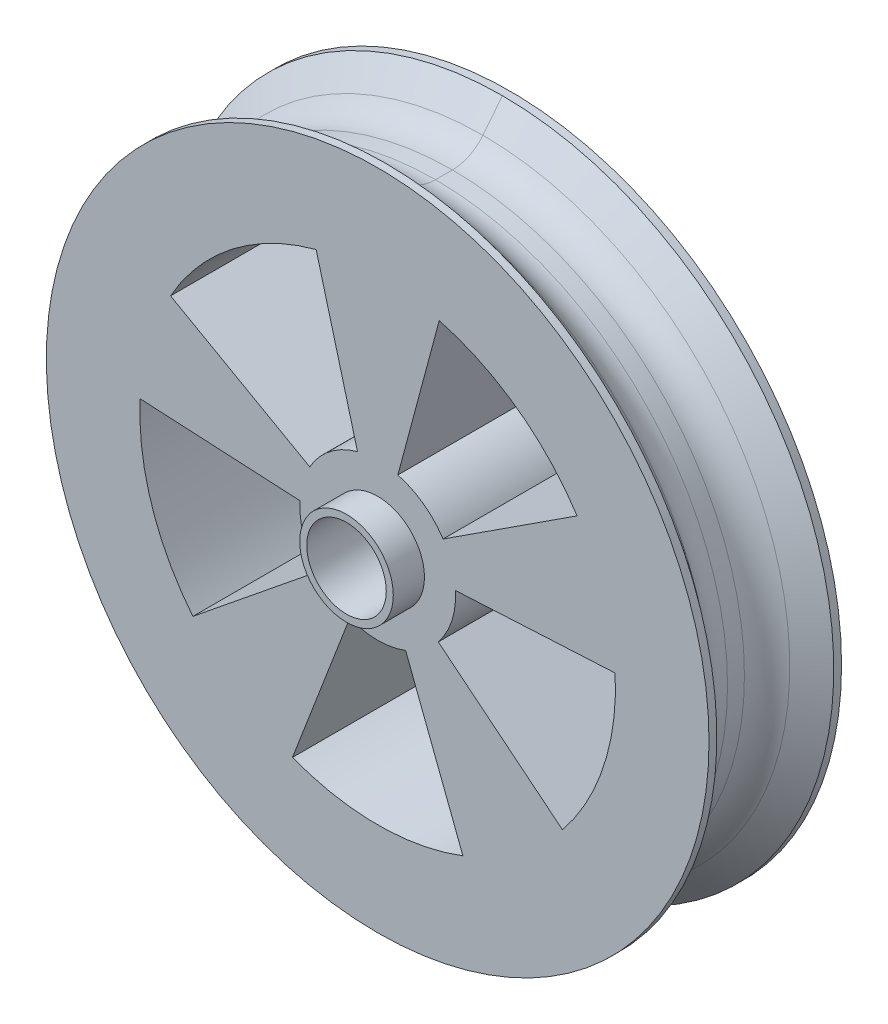
ISO-10303-21;
HEADER;
FILE_DESCRIPTION(('STEP AP214'),'2;1');
FILE_NAME('part.step','',(''),(''),'','','');
FILE_SCHEMA(('AUTOMOTIVE_DESIGN { 1 0 10303 214 1 1 1 1 }'));
ENDSEC;
DATA;
#1=APPLICATION_CONTEXT('core data for automotive mechanical design processes');
#2=APPLICATION_PROTOCOL_DEFINITION('international standard','automotive_design',2000,#1);
#3=PRODUCT_CONTEXT('',#1,'mechanical');
#4=PRODUCT('Part','Part','',(#3));
#5=PRODUCT_RELATED_PRODUCT_CATEGORY('part','',(#4));
#6=PRODUCT_DEFINITION_FORMATION('','',#4);
#7=PRODUCT_DEFINITION_CONTEXT('part definition',#1,'design');
#8=PRODUCT_DEFINITION('design','',#6,#7);
#9=PRODUCT_DEFINITION_SHAPE('','',#8);
#10=(LENGTH_UNIT() NAMED_UNIT(*) SI_UNIT(.MILLI.,.METRE.));
#11=(NAMED_UNIT(*) PLANE_ANGLE_UNIT() SI_UNIT($,.RADIAN.));
#12=(NAMED_UNIT(*) SI_UNIT($,.STERADIAN.) SOLID_ANGLE_UNIT());
#13=UNCERTAINTY_MEASURE_WITH_UNIT(LENGTH_MEASURE(1.E-05),#10,'distance_accuracy_value','');
#14=(GEOMETRIC_REPRESENTATION_CONTEXT(3) GLOBAL_UNCERTAINTY_ASSIGNED_CONTEXT((#13)) GLOBAL_UNIT_ASSIGNED_CONTEXT((#10,
#11,#12)) REPRESENTATION_CONTEXT('',''));
#15=CARTESIAN_POINT('',(0.,0.,0.));
#16=DIRECTION('',(0.,0.,1.));
#17=DIRECTION('',(1.,0.,0.));
#18=AXIS2_PLACEMENT_3D('',#15,#16,#17);
#19=CARTESIAN_POINT('',(0.,0.,7.41537261275771));
#20=DIRECTION('',(0.,0.,1.));
#21=DIRECTION('',(1.,0.,0.));
#22=AXIS2_PLACEMENT_3D('',#19,#20,#21);
#23=TOROIDAL_SURFACE('',#22,42.4590404977148,5.);
#24=CARTESIAN_POINT('',(0.,0.,7.41537261275771));
#25=DIRECTION('',(0.,0.,1.));
#26=DIRECTION('',(1.,0.,0.));
#27=AXIS2_PLACEMENT_3D('',#24,#25,#26);
#28=CIRCLE('',#27,37.4590404977148);
#29=CARTESIAN_POINT('',(0.,-37.4590404977148,7.41537261275771));
#30=VERTEX_POINT('',#29);
#31=CARTESIAN_POINT('',(0.,37.4590404977148,7.41537261275771));
#32=VERTEX_POINT('',#31);
#33=EDGE_CURVE('E452',#30,#32,#28,.T.);
#34=ORIENTED_EDGE('',*,*,#33,.F.);
#35=CARTESIAN_POINT('',(0.,-42.4590404977148,7.41537261275771));
#36=DIRECTION('',(-1.,0.,0.));
#37=DIRECTION('',(0.,0.,1.));
#38=AXIS2_PLACEMENT_3D('',#35,#36,#37);
#39=CIRCLE('',#38,5.);
#40=CARTESIAN_POINT('',(0.,-39.3511142328955,3.498640003497));
#41=VERTEX_POINT('',#40);
#42=EDGE_CURVE('E13',#30,#41,#39,.T.);
#43=ORIENTED_EDGE('',*,*,#42,.T.);
#44=CARTESIAN_POINT('',(0.,0.,3.498640003497));
#45=DIRECTION('',(0.,0.,1.));
#46=DIRECTION('',(1.,0.,0.));
#47=AXIS2_PLACEMENT_3D('',#44,#45,#46);
#48=CIRCLE('',#47,39.3511142328955);
#49=CARTESIAN_POINT('',(0.,39.3511142328955,3.498640003497));
#50=VERTEX_POINT('',#49);
#51=EDGE_CURVE('E456',#50,#41,#48,.F.);
#52=ORIENTED_EDGE('',*,*,#51,.F.);
#53=CARTESIAN_POINT('',(0.,42.4590404977148,7.41537261275771));
#54=DIRECTION('',(-1.,0.,0.));
#55=DIRECTION('',(0.,0.,1.));
#56=AXIS2_PLACEMENT_3D('',#53,#54,#55);
#57=CIRCLE('',#56,5.);
#58=EDGE_CURVE('E108',#50,#32,#57,.T.);
#59=ORIENTED_EDGE('',*,*,#58,.T.);
#60=EDGE_LOOP('',(#34,#43,#52,#59));
#61=FACE_BOUND('',#60,.T.);
#62=ADVANCED_FACE('F99',(#61),#23,.F.);
#63=CARTESIAN_POINT('',(0.,0.,0.));
#64=DIRECTION('',(0.,0.,1.));
#65=DIRECTION('',(1.,0.,0.));
#66=AXIS2_PLACEMENT_3D('',#63,#64,#65);
#67=CYLINDRICAL_SURFACE('',#66,37.4590404977148);
#68=EDGE_CURVE('E453',#32,#30,#28,.T.);
#69=ORIENTED_EDGE('',*,*,#68,.T.);
#70=DIRECTION('',(0.,0.,1.));
#71=VECTOR('',#70,1.);
#72=CARTESIAN_POINT('',(0.,-37.4590404977148,0.));
#73=LINE('',#72,#71);
#74=CARTESIAN_POINT('',(0.,-37.4590404977148,9.58462738724229));
#75=VERTEX_POINT('',#74);
#76=EDGE_CURVE('E493',#30,#75,#73,.T.);
#77=ORIENTED_EDGE('',*,*,#76,.T.);
#78=CARTESIAN_POINT('',(0.,0.,9.58462738724229));
#79=DIRECTION('',(0.,0.,1.));
#80=DIRECTION('',(1.,0.,0.));
#81=AXIS2_PLACEMENT_3D('',#78,#79,#80);
#82=CIRCLE('',#81,37.4590404977148);
#83=CARTESIAN_POINT('',(0.,37.4590404977148,9.58462738724229));
#84=VERTEX_POINT('',#83);
#85=EDGE_CURVE('E464',#75,#84,#82,.F.);
#86=ORIENTED_EDGE('',*,*,#85,.T.);
#87=DIRECTION('',(0.,0.,-1.));
#88=VECTOR('',#87,1.);
#89=CARTESIAN_POINT('',(0.,37.4590404977148,0.));
#90=LINE('',#89,#88);
#91=EDGE_CURVE('E489',#84,#32,#90,.T.);
#92=ORIENTED_EDGE('',*,*,#91,.T.);
#93=EDGE_LOOP('',(#69,#77,#86,#92));
#94=FACE_BOUND('',#93,.T.);
#95=ADVANCED_FACE('F518',(#94),#67,.T.);
#96=CARTESIAN_POINT('',(0.,0.,9.58462738724229));
#97=DIRECTION('',(0.,0.,1.));
#98=DIRECTION('',(1.,0.,0.));
#99=AXIS2_PLACEMENT_3D('',#96,#97,#98);
#100=TOROIDAL_SURFACE('',#99,42.4590404977148,5.);
#101=CARTESIAN_POINT('',(0.,0.,13.501359996503));
#102=DIRECTION('',(0.,0.,1.));
#103=DIRECTION('',(1.,0.,0.));
#104=AXIS2_PLACEMENT_3D('',#101,#102,#103);
#105=CIRCLE('',#104,39.3511142328955);
#106=CARTESIAN_POINT('',(0.,-39.3511142328954,13.501359996503));
#107=VERTEX_POINT('',#106);
#108=CARTESIAN_POINT('',(0.,39.3511142328954,13.501359996503));
#109=VERTEX_POINT('',#108);
#110=EDGE_CURVE('E460',#107,#109,#105,.T.);
#111=ORIENTED_EDGE('',*,*,#110,.F.);
#112=CARTESIAN_POINT('',(0.,-42.4590404977148,9.58462738724229));
#113=DIRECTION('',(-1.,0.,0.));
#114=DIRECTION('',(0.,0.,1.));
#115=AXIS2_PLACEMENT_3D('',#112,#113,#114);
#116=CIRCLE('',#115,5.);
#117=EDGE_CURVE('E485',#107,#75,#116,.T.);
#118=ORIENTED_EDGE('',*,*,#117,.T.);
#119=EDGE_CURVE('E465',#84,#75,#82,.F.);
#120=ORIENTED_EDGE('',*,*,#119,.F.);
#121=CARTESIAN_POINT('',(0.,42.4590404977148,9.58462738724229));
#122=DIRECTION('',(-1.,0.,0.));
#123=DIRECTION('',(0.,0.,1.));
#124=AXIS2_PLACEMENT_3D('',#121,#122,#123);
#125=CIRCLE('',#124,5.);
#126=EDGE_CURVE('E482',#84,#109,#125,.T.);
#127=ORIENTED_EDGE('',*,*,#126,.T.);
#128=EDGE_LOOP('',(#111,#118,#120,#127));
#129=FACE_BOUND('',#128,.T.);
#130=ADVANCED_FACE('F525',(#129),#100,.F.);
#131=CARTESIAN_POINT('',(0.,0.,12.));
#132=DIRECTION('',(0.,0.,1.));
#133=DIRECTION('',(1.,0.,0.));
#134=AXIS2_PLACEMENT_3D('',#131,#132,#133);
#135=CONICAL_SURFACE('',#134,37.4590404977148,0.900031551319247);
#136=EDGE_CURVE('E461',#109,#107,#105,.T.);
#137=ORIENTED_EDGE('',*,*,#136,.T.);
#138=DIRECTION('',(0.,-0.783346521852141,0.621585252963866));
#139=VECTOR('',#138,1.);
#140=CARTESIAN_POINT('',(0.,-37.4590404977148,12.));
#141=LINE('',#140,#139);
#142=CARTESIAN_POINT('',(0.,-42.5,16.));
#143=VERTEX_POINT('',#142);
#144=EDGE_CURVE('E479',#107,#143,#141,.T.);
#145=ORIENTED_EDGE('',*,*,#144,.T.);
#146=CARTESIAN_POINT('',(0.,0.,16.));
#147=DIRECTION('',(0.,0.,1.));
#148=DIRECTION('',(1.,0.,0.));
#149=AXIS2_PLACEMENT_3D('',#146,#147,#148);
#150=CIRCLE('',#149,42.5);
#151=CARTESIAN_POINT('',(0.,42.5,16.));
#152=VERTEX_POINT('',#151);
#153=EDGE_CURVE('E548',#152,#143,#150,.T.);
#154=ORIENTED_EDGE('',*,*,#153,.F.);
#155=DIRECTION('',(0.,-0.783346521852141,-0.621585252963866));
#156=VECTOR('',#155,1.);
#157=CARTESIAN_POINT('',(0.,37.4590404977148,12.));
#158=LINE('',#157,#156);
#159=EDGE_CURVE('E475',#152,#109,#158,.T.);
#160=ORIENTED_EDGE('',*,*,#159,.T.);
#161=EDGE_LOOP('',(#137,#145,#154,#160));
#162=FACE_BOUND('',#161,.T.);
#163=ADVANCED_FACE('F613',(#162),#135,.T.);
#164=CARTESIAN_POINT('',(0.,0.,5.));
#165=DIRECTION('',(0.,0.,-1.));
#166=DIRECTION('',(-1.,0.,0.));
#167=AXIS2_PLACEMENT_3D('',#164,#165,#166);
#168=CONICAL_SURFACE('',#167,37.4590404977148,0.900031551319247);
#169=EDGE_CURVE('E457',#41,#50,#48,.F.);
#170=ORIENTED_EDGE('',*,*,#169,.T.);
#171=DIRECTION('',(0.,0.783346521852141,-0.621585252963866));
#172=VECTOR('',#171,1.);
#173=CARTESIAN_POINT('',(0.,37.4590404977148,5.));
#174=LINE('',#173,#172);
#175=CARTESIAN_POINT('',(0.,42.5,0.999999999999997));
#176=VERTEX_POINT('',#175);
#177=EDGE_CURVE('E472',#50,#176,#174,.T.);
#178=ORIENTED_EDGE('',*,*,#177,.T.);
#179=CARTESIAN_POINT('',(0.,0.,0.999999999999997));
#180=DIRECTION('',(0.,0.,1.));
#181=DIRECTION('',(1.,0.,0.));
#182=AXIS2_PLACEMENT_3D('',#179,#180,#181);
#183=CIRCLE('',#182,42.5);
#184=CARTESIAN_POINT('',(0.,-42.5,0.999999999999997));
#185=VERTEX_POINT('',#184);
#186=EDGE_CURVE('E543',#176,#185,#183,.T.);
#187=ORIENTED_EDGE('',*,*,#186,.T.);
#188=DIRECTION('',(0.,0.783346521852141,0.621585252963866));
#189=VECTOR('',#188,1.);
#190=CARTESIAN_POINT('',(0.,-37.4590404977148,5.));
#191=LINE('',#190,#189);
#192=EDGE_CURVE('E468',#185,#41,#191,.T.);
#193=ORIENTED_EDGE('',*,*,#192,.T.);
#194=EDGE_LOOP('',(#170,#178,#187,#193));
#195=FACE_BOUND('',#194,.T.);
#196=ADVANCED_FACE('F542',(#195),#168,.T.);
#197=CARTESIAN_POINT('',(0.,0.,17.));
#198=DIRECTION('',(0.,0.,-1.));
#199=DIRECTION('',(-1.,0.,0.));
#200=AXIS2_PLACEMENT_3D('',#197,#198,#199);
#201=CYLINDRICAL_SURFACE('',#200,42.5);
#202=CARTESIAN_POINT('',(0.,0.,0.));
#203=DIRECTION('',(0.,0.,1.));
#204=DIRECTION('',(1.,0.,0.));
#205=AXIS2_PLACEMENT_3D('',#202,#203,#204);
#206=CIRCLE('',#205,42.5);
#207=CARTESIAN_POINT('',(42.5,0.,0.));
#208=VERTEX_POINT('',#207);
#209=EDGE_CURVE('E437',#208,#208,#206,.T.);
#210=ORIENTED_EDGE('',*,*,#209,.T.);
#211=EDGE_LOOP('',(#210));
#212=FACE_BOUND('',#211,.T.);
#213=EDGE_CURVE('E539',#185,#176,#183,.T.);
#214=ORIENTED_EDGE('',*,*,#213,.F.);
#215=ORIENTED_EDGE('',*,*,#186,.F.);
#216=EDGE_LOOP('',(#214,#215));
#217=FACE_BOUND('',#216,.T.);
#218=ADVANCED_FACE('F545',(#212,#217),#201,.T.);
#219=CARTESIAN_POINT('',(0.,0.,0.));
#220=DIRECTION('',(0.,0.,1.));
#221=DIRECTION('',(1.,0.,0.));
#222=AXIS2_PLACEMENT_3D('',#219,#220,#221);
#223=PLANE('',#222);
#224=ORIENTED_EDGE('',*,*,#209,.F.);
#225=EDGE_LOOP('',(#224));
#226=FACE_BOUND('',#225,.T.);
#227=CARTESIAN_POINT('',(0.,0.,0.));
#228=DIRECTION('',(0.,0.,1.));
#229=DIRECTION('',(1.,0.,0.));
#230=AXIS2_PLACEMENT_3D('',#227,#228,#229);
#231=CIRCLE('',#230,10.);
#232=CARTESIAN_POINT('',(-2.58819045102522,9.65925826289068,0.));
#233=VERTEX_POINT('',#232);
#234=CARTESIAN_POINT('',(-8.71167084936542,4.90986670005581,0.));
#235=VERTEX_POINT('',#234);
#236=EDGE_CURVE('E423',#233,#235,#231,.T.);
#237=ORIENTED_EDGE('',*,*,#236,.F.);
#238=DIRECTION('',(-0.258819045102522,0.965925826289068,0.));
#239=VECTOR('',#238,1.);
#240=CARTESIAN_POINT('',(0.,0.,0.));
#241=LINE('',#240,#239);
#242=CARTESIAN_POINT('',(-7.89398087562691,29.4607377018166,0.));
#243=VERTEX_POINT('',#242);
#244=EDGE_CURVE('E413',#233,#243,#241,.T.);
#245=ORIENTED_EDGE('',*,*,#244,.T.);
#246=CARTESIAN_POINT('',(0.,0.,0.));
#247=DIRECTION('',(0.,0.,1.));
#248=DIRECTION('',(1.,0.,0.));
#249=AXIS2_PLACEMENT_3D('',#246,#247,#248);
#250=CIRCLE('',#249,30.5);
#251=CARTESIAN_POINT('',(-26.5705960905645,14.9750934351702,0.));
#252=VERTEX_POINT('',#251);
#253=EDGE_CURVE('E416',#243,#252,#250,.T.);
#254=ORIENTED_EDGE('',*,*,#253,.T.);
#255=DIRECTION('',(-0.871167084936541,0.490986670005581,0.));
#256=VECTOR('',#255,1.);
#257=CARTESIAN_POINT('',(0.,0.,0.));
#258=LINE('',#257,#256);
#259=EDGE_CURVE('E420',#235,#252,#258,.T.);
#260=ORIENTED_EDGE('',*,*,#259,.F.);
#261=EDGE_LOOP('',(#237,#245,#254,#260));
#262=FACE_BOUND('',#261,.T.);
#263=CARTESIAN_POINT('',(0.,0.,0.));
#264=DIRECTION('',(0.,0.,1.));
#265=DIRECTION('',(1.,0.,0.));
#266=AXIS2_PLACEMENT_3D('',#263,#264,#265);
#267=CIRCLE('',#266,10.);
#268=CARTESIAN_POINT('',(-3.58367949545307,-9.33580426497199,0.));
#269=VERTEX_POINT('',#268);
#270=CARTESIAN_POINT('',(3.58367949545294,-9.33580426497204,0.));
#271=VERTEX_POINT('',#270);
#272=EDGE_CURVE('E330',#269,#271,#267,.T.);
#273=ORIENTED_EDGE('',*,*,#272,.F.);
#274=DIRECTION('',(-0.358367949545307,-0.933580426497199,0.));
#275=VECTOR('',#274,1.);
#276=CARTESIAN_POINT('',(0.,0.,0.));
#277=LINE('',#276,#275);
#278=CARTESIAN_POINT('',(-10.9302224611319,-28.4742030081646,0.));
#279=VERTEX_POINT('',#278);
#280=EDGE_CURVE('E320',#269,#279,#277,.T.);
#281=ORIENTED_EDGE('',*,*,#280,.T.);
#282=CARTESIAN_POINT('',(0.,0.,0.));
#283=DIRECTION('',(0.,0.,1.));
#284=DIRECTION('',(1.,0.,0.));
#285=AXIS2_PLACEMENT_3D('',#282,#283,#284);
#286=CIRCLE('',#285,30.5);
#287=CARTESIAN_POINT('',(10.9302224611315,-28.4742030081647,0.));
#288=VERTEX_POINT('',#287);
#289=EDGE_CURVE('E323',#279,#288,#286,.T.);
#290=ORIENTED_EDGE('',*,*,#289,.T.);
#291=DIRECTION('',(0.358367949545294,-0.933580426497204,0.));
#292=VECTOR('',#291,1.);
#293=CARTESIAN_POINT('',(0.,0.,0.));
#294=LINE('',#293,#292);
#295=EDGE_CURVE('E327',#271,#288,#294,.T.);
#296=ORIENTED_EDGE('',*,*,#295,.F.);
#297=EDGE_LOOP('',(#273,#281,#290,#296));
#298=FACE_BOUND('',#297,.T.);
#299=CARTESIAN_POINT('',(0.,0.,0.));
#300=DIRECTION('',(0.,0.,1.));
#301=DIRECTION('',(1.,0.,0.));
#302=AXIS2_PLACEMENT_3D('',#299,#300,#301);
#303=CIRCLE('',#302,10.);
#304=CARTESIAN_POINT('',(-9.98629534754573,0.523359562429543,0.));
#305=VERTEX_POINT('',#304);
#306=CARTESIAN_POINT('',(-7.77145961456976,-6.29320391049831,0.));
#307=VERTEX_POINT('',#306);
#308=EDGE_CURVE('E284',#305,#307,#303,.T.);
#309=ORIENTED_EDGE('',*,*,#308,.F.);
#310=DIRECTION('',(-0.998629534754574,0.0523359562429543,0.));
#311=VECTOR('',#310,1.);
#312=CARTESIAN_POINT('',(0.,0.,0.));
#313=LINE('',#312,#311);
#314=CARTESIAN_POINT('',(-30.4582008100145,1.59624666541011,0.));
#315=VERTEX_POINT('',#314);
#316=EDGE_CURVE('E276',#305,#315,#313,.T.);
#317=ORIENTED_EDGE('',*,*,#316,.T.);
#318=CARTESIAN_POINT('',(0.,0.,0.));
#319=DIRECTION('',(0.,0.,1.));
#320=DIRECTION('',(1.,0.,0.));
#321=AXIS2_PLACEMENT_3D('',#318,#319,#320);
#322=CIRCLE('',#321,30.5);
#323=CARTESIAN_POINT('',(-23.7029518244378,-19.1942719270198,0.));
#324=VERTEX_POINT('',#323);
#325=EDGE_CURVE('E287',#315,#324,#322,.T.);
#326=ORIENTED_EDGE('',*,*,#325,.T.);
#327=DIRECTION('',(-0.777145961456977,-0.629320391049831,0.));
#328=VECTOR('',#327,1.);
#329=CARTESIAN_POINT('',(0.,0.,0.));
#330=LINE('',#329,#328);
#331=EDGE_CURVE('E292',#307,#324,#330,.T.);
#332=ORIENTED_EDGE('',*,*,#331,.F.);
#333=EDGE_LOOP('',(#309,#317,#326,#332));
#334=FACE_BOUND('',#333,.T.);
#335=CARTESIAN_POINT('',(0.,0.,0.));
#336=DIRECTION('',(0.,0.,1.));
#337=DIRECTION('',(1.,0.,0.));
#338=AXIS2_PLACEMENT_3D('',#335,#336,#337);
#339=CIRCLE('',#338,10.);
#340=CARTESIAN_POINT('',(7.77145961456968,-6.29320391049841,0.));
#341=VERTEX_POINT('',#340);
#342=CARTESIAN_POINT('',(9.98629534754574,0.523359562429405,0.));
#343=VERTEX_POINT('',#342);
#344=EDGE_CURVE('E394',#341,#343,#339,.T.);
#345=ORIENTED_EDGE('',*,*,#344,.F.);
#346=DIRECTION('',(0.777145961456968,-0.629320391049841,0.));
#347=VECTOR('',#346,1.);
#348=CARTESIAN_POINT('',(0.,0.,0.));
#349=LINE('',#348,#347);
#350=CARTESIAN_POINT('',(23.7029518244375,-19.1942719270202,0.));
#351=VERTEX_POINT('',#350);
#352=EDGE_CURVE('E384',#341,#351,#349,.T.);
#353=ORIENTED_EDGE('',*,*,#352,.T.);
#354=CARTESIAN_POINT('',(0.,0.,0.));
#355=DIRECTION('',(0.,0.,1.));
#356=DIRECTION('',(1.,0.,0.));
#357=AXIS2_PLACEMENT_3D('',#354,#355,#356);
#358=CIRCLE('',#357,30.5);
#359=CARTESIAN_POINT('',(30.4582008100145,1.59624666540968,0.));
#360=VERTEX_POINT('',#359);
#361=EDGE_CURVE('E387',#351,#360,#358,.T.);
#362=ORIENTED_EDGE('',*,*,#361,.T.);
#363=DIRECTION('',(0.998629534754574,0.0523359562429404,0.));
#364=VECTOR('',#363,1.);
#365=CARTESIAN_POINT('',(0.,0.,0.));
#366=LINE('',#365,#364);
#367=EDGE_CURVE('E391',#343,#360,#366,.T.);
#368=ORIENTED_EDGE('',*,*,#367,.F.);
#369=EDGE_LOOP('',(#345,#353,#362,#368));
#370=FACE_BOUND('',#369,.T.);
#371=CARTESIAN_POINT('',(0.,0.,0.));
#372=DIRECTION('',(0.,0.,1.));
#373=DIRECTION('',(1.,0.,0.));
#374=AXIS2_PLACEMENT_3D('',#371,#372,#373);
#375=CIRCLE('',#374,10.);
#376=CARTESIAN_POINT('',(8.38670567945425,5.44639035015026,0.));
#377=VERTEX_POINT('',#376);
#378=CARTESIAN_POINT('',(2.58819045102521,9.65925826289068,0.));
#379=VERTEX_POINT('',#378);
#380=EDGE_CURVE('E361',#377,#379,#375,.T.);
#381=ORIENTED_EDGE('',*,*,#380,.F.);
#382=DIRECTION('',(0.838670567945425,0.544639035015026,0.));
#383=VECTOR('',#382,1.);
#384=CARTESIAN_POINT('',(0.,0.,0.));
#385=LINE('',#384,#383);
#386=CARTESIAN_POINT('',(25.5794523223355,16.6114905679583,0.));
#387=VERTEX_POINT('',#386);
#388=EDGE_CURVE('E351',#377,#387,#385,.T.);
#389=ORIENTED_EDGE('',*,*,#388,.T.);
#390=CARTESIAN_POINT('',(0.,0.,0.));
#391=DIRECTION('',(0.,0.,1.));
#392=DIRECTION('',(1.,0.,0.));
#393=AXIS2_PLACEMENT_3D('',#390,#391,#392);
#394=CIRCLE('',#393,30.5);
#395=CARTESIAN_POINT('',(7.89398087562691,29.4607377018166,0.));
#396=VERTEX_POINT('',#395);
#397=EDGE_CURVE('E354',#387,#396,#394,.T.);
#398=ORIENTED_EDGE('',*,*,#397,.T.);
#399=DIRECTION('',(0.258819045102521,0.965925826289068,0.));
#400=VECTOR('',#399,1.);
#401=CARTESIAN_POINT('',(0.,0.,0.));
#402=LINE('',#401,#400);
#403=EDGE_CURVE('E358',#379,#396,#402,.T.);
#404=ORIENTED_EDGE('',*,*,#403,.F.);
#405=EDGE_LOOP('',(#381,#389,#398,#404));
#406=FACE_BOUND('',#405,.T.);
#407=CARTESIAN_POINT('',(0.,0.,0.));
#408=DIRECTION('',(0.,0.,1.));
#409=DIRECTION('',(1.,0.,0.));
#410=AXIS2_PLACEMENT_3D('',#407,#408,#409);
#411=CIRCLE('',#410,6.);
#412=CARTESIAN_POINT('',(6.,0.,0.));
#413=VERTEX_POINT('',#412);
#414=EDGE_CURVE('E447',#413,#413,#411,.F.);
#415=ORIENTED_EDGE('',*,*,#414,.F.);
#416=EDGE_LOOP('',(#415));
#417=FACE_BOUND('',#416,.T.);
#418=ADVANCED_FACE('F294',(#226,#262,#298,#334,#370,#406,#417),#223,.F.);
#419=CARTESIAN_POINT('',(0.,0.,17.));
#420=DIRECTION('',(0.,0.,1.));
#421=DIRECTION('',(1.,0.,0.));
#422=AXIS2_PLACEMENT_3D('',#419,#420,#421);
#423=PLANE('',#422);
#424=CARTESIAN_POINT('',(0.,0.,17.));
#425=DIRECTION('',(0.,0.,1.));
#426=DIRECTION('',(1.,0.,0.));
#427=AXIS2_PLACEMENT_3D('',#424,#425,#426);
#428=CIRCLE('',#427,42.5);
#429=CARTESIAN_POINT('',(42.5,0.,17.));
#430=VERTEX_POINT('',#429);
#431=EDGE_CURVE('E444',#430,#430,#428,.T.);
#432=ORIENTED_EDGE('',*,*,#431,.T.);
#433=EDGE_LOOP('',(#432));
#434=FACE_BOUND('',#433,.T.);
#435=DIRECTION('',(-0.258819045102522,0.965925826289068,0.));
#436=VECTOR('',#435,1.);
#437=CARTESIAN_POINT('',(0.,0.,17.));
#438=LINE('',#437,#436);
#439=CARTESIAN_POINT('',(-2.58819045102522,9.65925826289068,17.));
#440=VERTEX_POINT('',#439);
#441=CARTESIAN_POINT('',(-7.89398087562691,29.4607377018166,17.));
#442=VERTEX_POINT('',#441);
#443=EDGE_CURVE('E377',#440,#442,#438,.T.);
#444=ORIENTED_EDGE('',*,*,#443,.F.);
#445=CARTESIAN_POINT('',(0.,0.,17.));
#446=DIRECTION('',(0.,0.,1.));
#447=DIRECTION('',(1.,0.,0.));
#448=AXIS2_PLACEMENT_3D('',#445,#446,#447);
#449=CIRCLE('',#448,10.);
#450=CARTESIAN_POINT('',(-8.71167084936542,4.90986670005581,17.));
#451=VERTEX_POINT('',#450);
#452=EDGE_CURVE('E417',#440,#451,#449,.T.);
#453=ORIENTED_EDGE('',*,*,#452,.T.);
#454=DIRECTION('',(-0.871167084936541,0.490986670005581,0.));
#455=VECTOR('',#454,1.);
#456=CARTESIAN_POINT('',(0.,0.,17.));
#457=LINE('',#456,#455);
#458=CARTESIAN_POINT('',(-26.5705960905645,14.9750934351702,17.));
#459=VERTEX_POINT('',#458);
#460=EDGE_CURVE('E430',#451,#459,#457,.T.);
#461=ORIENTED_EDGE('',*,*,#460,.T.);
#462=CARTESIAN_POINT('',(0.,0.,17.));
#463=DIRECTION('',(0.,0.,1.));
#464=DIRECTION('',(1.,0.,0.));
#465=AXIS2_PLACEMENT_3D('',#462,#463,#464);
#466=CIRCLE('',#465,30.5);
#467=EDGE_CURVE('E427',#442,#459,#466,.T.);
#468=ORIENTED_EDGE('',*,*,#467,.F.);
#469=EDGE_LOOP('',(#444,#453,#461,#468));
#470=FACE_BOUND('',#469,.T.);
#471=DIRECTION('',(-0.358367949545307,-0.933580426497199,0.));
#472=VECTOR('',#471,1.);
#473=CARTESIAN_POINT('',(0.,0.,17.));
#474=LINE('',#473,#472);
#475=CARTESIAN_POINT('',(-3.58367949545307,-9.33580426497199,17.));
#476=VERTEX_POINT('',#475);
#477=CARTESIAN_POINT('',(-10.9302224611319,-28.4742030081646,17.));
#478=VERTEX_POINT('',#477);
#479=EDGE_CURVE('E316',#476,#478,#474,.T.);
#480=ORIENTED_EDGE('',*,*,#479,.F.);
#481=CARTESIAN_POINT('',(0.,0.,17.));
#482=DIRECTION('',(0.,0.,1.));
#483=DIRECTION('',(1.,0.,0.));
#484=AXIS2_PLACEMENT_3D('',#481,#482,#483);
#485=CIRCLE('',#484,10.);
#486=CARTESIAN_POINT('',(3.58367949545294,-9.33580426497204,17.));
#487=VERTEX_POINT('',#486);
#488=EDGE_CURVE('E324',#476,#487,#485,.T.);
#489=ORIENTED_EDGE('',*,*,#488,.T.);
#490=DIRECTION('',(0.358367949545294,-0.933580426497204,0.));
#491=VECTOR('',#490,1.);
#492=CARTESIAN_POINT('',(0.,0.,17.));
#493=LINE('',#492,#491);
#494=CARTESIAN_POINT('',(10.9302224611315,-28.4742030081647,17.));
#495=VERTEX_POINT('',#494);
#496=EDGE_CURVE('E337',#487,#495,#493,.T.);
#497=ORIENTED_EDGE('',*,*,#496,.T.);
#498=CARTESIAN_POINT('',(0.,0.,17.));
#499=DIRECTION('',(0.,0.,1.));
#500=DIRECTION('',(1.,0.,0.));
#501=AXIS2_PLACEMENT_3D('',#498,#499,#500);
#502=CIRCLE('',#501,30.5);
#503=EDGE_CURVE('E334',#478,#495,#502,.T.);
#504=ORIENTED_EDGE('',*,*,#503,.F.);
#505=EDGE_LOOP('',(#480,#489,#497,#504));
#506=FACE_BOUND('',#505,.T.);
#507=DIRECTION('',(-0.998629534754574,0.0523359562429543,0.));
#508=VECTOR('',#507,1.);
#509=CARTESIAN_POINT('',(0.,0.,17.));
#510=LINE('',#509,#508);
#511=CARTESIAN_POINT('',(-9.98629534754573,0.523359562429543,17.));
#512=VERTEX_POINT('',#511);
#513=CARTESIAN_POINT('',(-30.4582008100145,1.59624666541011,17.));
#514=VERTEX_POINT('',#513);
#515=EDGE_CURVE('E279',#512,#514,#510,.T.);
#516=ORIENTED_EDGE('',*,*,#515,.F.);
#517=CARTESIAN_POINT('',(0.,0.,17.));
#518=DIRECTION('',(0.,0.,1.));
#519=DIRECTION('',(1.,0.,0.));
#520=AXIS2_PLACEMENT_3D('',#517,#518,#519);
#521=CIRCLE('',#520,10.);
#522=CARTESIAN_POINT('',(-7.77145961456976,-6.29320391049831,17.));
#523=VERTEX_POINT('',#522);
#524=EDGE_CURVE('E296',#512,#523,#521,.T.);
#525=ORIENTED_EDGE('',*,*,#524,.T.);
#526=DIRECTION('',(-0.777145961456977,-0.629320391049831,0.));
#527=VECTOR('',#526,1.);
#528=CARTESIAN_POINT('',(0.,0.,17.));
#529=LINE('',#528,#527);
#530=CARTESIAN_POINT('',(-23.7029518244378,-19.1942719270198,17.));
#531=VERTEX_POINT('',#530);
#532=EDGE_CURVE('E299',#523,#531,#529,.T.);
#533=ORIENTED_EDGE('',*,*,#532,.T.);
#534=CARTESIAN_POINT('',(0.,0.,17.));
#535=DIRECTION('',(0.,0.,1.));
#536=DIRECTION('',(1.,0.,0.));
#537=AXIS2_PLACEMENT_3D('',#534,#535,#536);
#538=CIRCLE('',#537,30.5);
#539=EDGE_CURVE('E309',#514,#531,#538,.T.);
#540=ORIENTED_EDGE('',*,*,#539,.F.);
#541=EDGE_LOOP('',(#516,#525,#533,#540));
#542=FACE_BOUND('',#541,.T.);
#543=DIRECTION('',(0.777145961456968,-0.629320391049841,0.));
#544=VECTOR('',#543,1.);
#545=CARTESIAN_POINT('',(0.,0.,17.));
#546=LINE('',#545,#544);
#547=CARTESIAN_POINT('',(7.77145961456968,-6.29320391049841,17.));
#548=VERTEX_POINT('',#547);
#549=CARTESIAN_POINT('',(23.7029518244375,-19.1942719270202,17.));
#550=VERTEX_POINT('',#549);
#551=EDGE_CURVE('E344',#548,#550,#546,.T.);
#552=ORIENTED_EDGE('',*,*,#551,.F.);
#553=CARTESIAN_POINT('',(0.,0.,17.));
#554=DIRECTION('',(0.,0.,1.));
#555=DIRECTION('',(1.,0.,0.));
#556=AXIS2_PLACEMENT_3D('',#553,#554,#555);
#557=CIRCLE('',#556,10.);
#558=CARTESIAN_POINT('',(9.98629534754574,0.523359562429405,17.));
#559=VERTEX_POINT('',#558);
#560=EDGE_CURVE('E388',#548,#559,#557,.T.);
#561=ORIENTED_EDGE('',*,*,#560,.T.);
#562=DIRECTION('',(0.998629534754574,0.0523359562429404,0.));
#563=VECTOR('',#562,1.);
#564=CARTESIAN_POINT('',(0.,0.,17.));
#565=LINE('',#564,#563);
#566=CARTESIAN_POINT('',(30.4582008100145,1.59624666540968,17.));
#567=VERTEX_POINT('',#566);
#568=EDGE_CURVE('E401',#559,#567,#565,.T.);
#569=ORIENTED_EDGE('',*,*,#568,.T.);
#570=CARTESIAN_POINT('',(0.,0.,17.));
#571=DIRECTION('',(0.,0.,1.));
#572=DIRECTION('',(1.,0.,0.));
#573=AXIS2_PLACEMENT_3D('',#570,#571,#572);
#574=CIRCLE('',#573,30.5);
#575=EDGE_CURVE('E398',#550,#567,#574,.T.);
#576=ORIENTED_EDGE('',*,*,#575,.F.);
#577=EDGE_LOOP('',(#552,#561,#569,#576));
#578=FACE_BOUND('',#577,.T.);
#579=DIRECTION('',(0.838670567945425,0.544639035015026,0.));
#580=VECTOR('',#579,1.);
#581=CARTESIAN_POINT('',(0.,0.,17.));
#582=LINE('',#581,#580);
#583=CARTESIAN_POINT('',(8.38670567945425,5.44639035015026,17.));
#584=VERTEX_POINT('',#583);
#585=CARTESIAN_POINT('',(25.5794523223355,16.6114905679583,17.));
#586=VERTEX_POINT('',#585);
#587=EDGE_CURVE('E364',#584,#586,#582,.T.);
#588=ORIENTED_EDGE('',*,*,#587,.F.);
#589=CARTESIAN_POINT('',(0.,0.,17.));
#590=DIRECTION('',(0.,0.,1.));
#591=DIRECTION('',(1.,0.,0.));
#592=AXIS2_PLACEMENT_3D('',#589,#590,#591);
#593=CIRCLE('',#592,10.);
#594=CARTESIAN_POINT('',(2.58819045102521,9.65925826289068,17.));
#595=VERTEX_POINT('',#594);
#596=EDGE_CURVE('E355',#584,#595,#593,.T.);
#597=ORIENTED_EDGE('',*,*,#596,.T.);
#598=DIRECTION('',(0.258819045102521,0.965925826289068,0.));
#599=VECTOR('',#598,1.);
#600=CARTESIAN_POINT('',(0.,0.,17.));
#601=LINE('',#600,#599);
#602=CARTESIAN_POINT('',(7.89398087562691,29.4607377018166,17.));
#603=VERTEX_POINT('',#602);
#604=EDGE_CURVE('E370',#595,#603,#601,.T.);
#605=ORIENTED_EDGE('',*,*,#604,.T.);
#606=CARTESIAN_POINT('',(0.,0.,17.));
#607=DIRECTION('',(0.,0.,1.));
#608=DIRECTION('',(1.,0.,0.));
#609=AXIS2_PLACEMENT_3D('',#606,#607,#608);
#610=CIRCLE('',#609,30.5);
#611=EDGE_CURVE('E366',#586,#603,#610,.T.);
#612=ORIENTED_EDGE('',*,*,#611,.F.);
#613=EDGE_LOOP('',(#588,#597,#605,#612));
#614=FACE_BOUND('',#613,.T.);
#615=CARTESIAN_POINT('',(0.,0.,17.));
#616=DIRECTION('',(0.,0.,1.));
#617=DIRECTION('',(1.,0.,0.));
#618=AXIS2_PLACEMENT_3D('',#615,#616,#617);
#619=CIRCLE('',#618,6.);
#620=CARTESIAN_POINT('',(6.,0.,17.));
#621=VERTEX_POINT('',#620);
#622=EDGE_CURVE('E302',#621,#621,#619,.T.);
#623=ORIENTED_EDGE('',*,*,#622,.F.);
#624=EDGE_LOOP('',(#623));
#625=FACE_BOUND('',#624,.T.);
#626=ADVANCED_FACE('F581',(#434,#470,#506,#542,#578,#614,#625),#423,.T.);
#627=ORIENTED_EDGE('',*,*,#153,.T.);
#628=EDGE_CURVE('E546',#143,#152,#150,.T.);
#629=ORIENTED_EDGE('',*,*,#628,.T.);
#630=EDGE_LOOP('',(#627,#629));
#631=FACE_BOUND('',#630,.T.);
#632=ORIENTED_EDGE('',*,*,#431,.F.);
#633=EDGE_LOOP('',(#632));
#634=FACE_BOUND('',#633,.T.);
#635=ADVANCED_FACE('F583',(#631,#634),#201,.T.);
#636=CARTESIAN_POINT('',(0.,0.,0.));
#637=DIRECTION('',(0.965925826289068,0.258819045102522,0.));
#638=DIRECTION('',(-0.258819045102522,0.965925826289068,0.));
#639=AXIS2_PLACEMENT_3D('',#636,#637,#638);
#640=PLANE('',#639);
#641=ORIENTED_EDGE('',*,*,#443,.T.);
#642=DIRECTION('',(0.,0.,1.));
#643=VECTOR('',#642,1.);
#644=CARTESIAN_POINT('',(-7.89398087562691,29.4607377018166,0.));
#645=LINE('',#644,#643);
#646=EDGE_CURVE('E425',#243,#442,#645,.T.);
#647=ORIENTED_EDGE('',*,*,#646,.F.);
#648=ORIENTED_EDGE('',*,*,#244,.F.);
#649=DIRECTION('',(0.,0.,1.));
#650=VECTOR('',#649,1.);
#651=CARTESIAN_POINT('',(-2.58819045102522,9.65925826289068,0.));
#652=LINE('',#651,#650);
#653=EDGE_CURVE('E435',#233,#440,#652,.T.);
#654=ORIENTED_EDGE('',*,*,#653,.T.);
#655=EDGE_LOOP('',(#641,#647,#648,#654));
#656=FACE_BOUND('',#655,.T.);
#657=ADVANCED_FACE('F590',(#656),#640,.F.);
#658=CARTESIAN_POINT('',(0.,0.,0.));
#659=DIRECTION('',(0.,0.,1.));
#660=DIRECTION('',(1.,0.,0.));
#661=AXIS2_PLACEMENT_3D('',#658,#659,#660);
#662=CYLINDRICAL_SURFACE('',#661,10.);
#663=ORIENTED_EDGE('',*,*,#452,.F.);
#664=ORIENTED_EDGE('',*,*,#653,.F.);
#665=ORIENTED_EDGE('',*,*,#236,.T.);
#666=DIRECTION('',(0.,0.,1.));
#667=VECTOR('',#666,1.);
#668=CARTESIAN_POINT('',(-8.71167084936542,4.90986670005581,0.));
#669=LINE('',#668,#667);
#670=EDGE_CURVE('E438',#235,#451,#669,.T.);
#671=ORIENTED_EDGE('',*,*,#670,.T.);
#672=EDGE_LOOP('',(#663,#664,#665,#671));
#673=FACE_BOUND('',#672,.T.);
#674=ADVANCED_FACE('F717',(#673),#662,.T.);
#675=CARTESIAN_POINT('',(0.,0.,0.));
#676=DIRECTION('',(0.490986670005581,0.871167084936541,0.));
#677=DIRECTION('',(-0.871167084936541,0.490986670005581,0.));
#678=AXIS2_PLACEMENT_3D('',#675,#676,#677);
#679=PLANE('',#678);
#680=ORIENTED_EDGE('',*,*,#460,.F.);
#681=ORIENTED_EDGE('',*,*,#670,.F.);
#682=ORIENTED_EDGE('',*,*,#259,.T.);
#683=DIRECTION('',(0.,0.,1.));
#684=VECTOR('',#683,1.);
#685=CARTESIAN_POINT('',(-26.5705960905645,14.9750934351702,0.));
#686=LINE('',#685,#684);
#687=EDGE_CURVE('E440',#252,#459,#686,.T.);
#688=ORIENTED_EDGE('',*,*,#687,.T.);
#689=EDGE_LOOP('',(#680,#681,#682,#688));
#690=FACE_BOUND('',#689,.T.);
#691=ADVANCED_FACE('F720',(#690),#679,.T.);
#692=CARTESIAN_POINT('',(0.,0.,0.));
#693=DIRECTION('',(0.,0.,1.));
#694=DIRECTION('',(1.,0.,0.));
#695=AXIS2_PLACEMENT_3D('',#692,#693,#694);
#696=CYLINDRICAL_SURFACE('',#695,30.5);
#697=ORIENTED_EDGE('',*,*,#467,.T.);
#698=ORIENTED_EDGE('',*,*,#687,.F.);
#699=ORIENTED_EDGE('',*,*,#253,.F.);
#700=ORIENTED_EDGE('',*,*,#646,.T.);
#701=EDGE_LOOP('',(#697,#698,#699,#700));
#702=FACE_BOUND('',#701,.T.);
#703=ADVANCED_FACE('F685',(#702),#696,.F.);
#704=CARTESIAN_POINT('',(0.,0.,0.));
#705=DIRECTION('',(-0.933580426497199,0.358367949545307,0.));
#706=DIRECTION('',(-0.358367949545307,-0.933580426497199,0.));
#707=AXIS2_PLACEMENT_3D('',#704,#705,#706);
#708=PLANE('',#707);
#709=ORIENTED_EDGE('',*,*,#479,.T.);
#710=DIRECTION('',(0.,0.,1.));
#711=VECTOR('',#710,1.);
#712=CARTESIAN_POINT('',(-10.9302224611319,-28.4742030081646,0.));
#713=LINE('',#712,#711);
#714=EDGE_CURVE('E332',#279,#478,#713,.T.);
#715=ORIENTED_EDGE('',*,*,#714,.F.);
#716=ORIENTED_EDGE('',*,*,#280,.F.);
#717=DIRECTION('',(0.,0.,1.));
#718=VECTOR('',#717,1.);
#719=CARTESIAN_POINT('',(-3.58367949545307,-9.33580426497199,0.));
#720=LINE('',#719,#718);
#721=EDGE_CURVE('E342',#269,#476,#720,.T.);
#722=ORIENTED_EDGE('',*,*,#721,.T.);
#723=EDGE_LOOP('',(#709,#715,#716,#722));
#724=FACE_BOUND('',#723,.T.);
#725=ADVANCED_FACE('F675',(#724),#708,.F.);
#726=CARTESIAN_POINT('',(0.,0.,0.));
#727=DIRECTION('',(0.,0.,1.));
#728=DIRECTION('',(1.,0.,0.));
#729=AXIS2_PLACEMENT_3D('',#726,#727,#728);
#730=CYLINDRICAL_SURFACE('',#729,10.);
#731=ORIENTED_EDGE('',*,*,#488,.F.);
#732=ORIENTED_EDGE('',*,*,#721,.F.);
#733=ORIENTED_EDGE('',*,*,#272,.T.);
#734=DIRECTION('',(0.,0.,1.));
#735=VECTOR('',#734,1.);
#736=CARTESIAN_POINT('',(3.58367949545294,-9.33580426497204,0.));
#737=LINE('',#736,#735);
#738=EDGE_CURVE('E345',#271,#487,#737,.T.);
#739=ORIENTED_EDGE('',*,*,#738,.T.);
#740=EDGE_LOOP('',(#731,#732,#733,#739));
#741=FACE_BOUND('',#740,.T.);
#742=ADVANCED_FACE('F671',(#741),#730,.T.);
#743=CARTESIAN_POINT('',(0.,0.,0.));
#744=DIRECTION('',(-0.933580426497204,-0.358367949545294,0.));
#745=DIRECTION('',(0.358367949545294,-0.933580426497204,0.));
#746=AXIS2_PLACEMENT_3D('',#743,#744,#745);
#747=PLANE('',#746);
#748=ORIENTED_EDGE('',*,*,#496,.F.);
#749=ORIENTED_EDGE('',*,*,#738,.F.);
#750=ORIENTED_EDGE('',*,*,#295,.T.);
#751=DIRECTION('',(0.,0.,1.));
#752=VECTOR('',#751,1.);
#753=CARTESIAN_POINT('',(10.9302224611315,-28.4742030081647,0.));
#754=LINE('',#753,#752);
#755=EDGE_CURVE('E347',#288,#495,#754,.T.);
#756=ORIENTED_EDGE('',*,*,#755,.T.);
#757=EDGE_LOOP('',(#748,#749,#750,#756));
#758=FACE_BOUND('',#757,.T.);
#759=ADVANCED_FACE('F674',(#758),#747,.T.);
#760=CARTESIAN_POINT('',(0.,0.,0.));
#761=DIRECTION('',(0.,0.,1.));
#762=DIRECTION('',(1.,0.,0.));
#763=AXIS2_PLACEMENT_3D('',#760,#761,#762);
#764=CYLINDRICAL_SURFACE('',#763,30.5);
#765=ORIENTED_EDGE('',*,*,#503,.T.);
#766=ORIENTED_EDGE('',*,*,#755,.F.);
#767=ORIENTED_EDGE('',*,*,#289,.F.);
#768=ORIENTED_EDGE('',*,*,#714,.T.);
#769=EDGE_LOOP('',(#765,#766,#767,#768));
#770=FACE_BOUND('',#769,.T.);
#771=ADVANCED_FACE('F670',(#770),#764,.F.);
#772=CARTESIAN_POINT('',(0.,0.,0.));
#773=DIRECTION('',(0.0523359562429543,0.998629534754573,0.));
#774=DIRECTION('',(-0.998629534754574,0.0523359562429543,0.));
#775=AXIS2_PLACEMENT_3D('',#772,#773,#774);
#776=PLANE('',#775);
#777=ORIENTED_EDGE('',*,*,#515,.T.);
#778=DIRECTION('',(0.,0.,1.));
#779=VECTOR('',#778,1.);
#780=CARTESIAN_POINT('',(-30.4582008100145,1.59624666541011,0.));
#781=LINE('',#780,#779);
#782=EDGE_CURVE('E272',#315,#514,#781,.T.);
#783=ORIENTED_EDGE('',*,*,#782,.F.);
#784=ORIENTED_EDGE('',*,*,#316,.F.);
#785=DIRECTION('',(0.,0.,1.));
#786=VECTOR('',#785,1.);
#787=CARTESIAN_POINT('',(-9.98629534754573,0.523359562429543,0.));
#788=LINE('',#787,#786);
#789=EDGE_CURVE('E314',#305,#512,#788,.T.);
#790=ORIENTED_EDGE('',*,*,#789,.T.);
#791=EDGE_LOOP('',(#777,#783,#784,#790));
#792=FACE_BOUND('',#791,.T.);
#793=ADVANCED_FACE('F274',(#792),#776,.F.);
#794=CARTESIAN_POINT('',(0.,0.,0.));
#795=DIRECTION('',(0.,0.,1.));
#796=DIRECTION('',(1.,0.,0.));
#797=AXIS2_PLACEMENT_3D('',#794,#795,#796);
#798=CYLINDRICAL_SURFACE('',#797,10.);
#799=ORIENTED_EDGE('',*,*,#524,.F.);
#800=ORIENTED_EDGE('',*,*,#789,.F.);
#801=ORIENTED_EDGE('',*,*,#308,.T.);
#802=DIRECTION('',(0.,0.,1.));
#803=VECTOR('',#802,1.);
#804=CARTESIAN_POINT('',(-7.77145961456976,-6.29320391049831,0.));
#805=LINE('',#804,#803);
#806=EDGE_CURVE('E317',#307,#523,#805,.T.);
#807=ORIENTED_EDGE('',*,*,#806,.T.);
#808=EDGE_LOOP('',(#799,#800,#801,#807));
#809=FACE_BOUND('',#808,.T.);
#810=ADVANCED_FACE('F657',(#809),#798,.T.);
#811=CARTESIAN_POINT('',(0.,0.,0.));
#812=DIRECTION('',(-0.629320391049831,0.777145961456977,0.));
#813=DIRECTION('',(-0.777145961456977,-0.629320391049831,0.));
#814=AXIS2_PLACEMENT_3D('',#811,#812,#813);
#815=PLANE('',#814);
#816=ORIENTED_EDGE('',*,*,#532,.F.);
#817=ORIENTED_EDGE('',*,*,#806,.F.);
#818=ORIENTED_EDGE('',*,*,#331,.T.);
#819=DIRECTION('',(0.,0.,1.));
#820=VECTOR('',#819,1.);
#821=CARTESIAN_POINT('',(-23.7029518244378,-19.1942719270198,0.));
#822=LINE('',#821,#820);
#823=EDGE_CURVE('E283',#324,#531,#822,.T.);
#824=ORIENTED_EDGE('',*,*,#823,.T.);
#825=EDGE_LOOP('',(#816,#817,#818,#824));
#826=FACE_BOUND('',#825,.T.);
#827=ADVANCED_FACE('F660',(#826),#815,.T.);
#828=CARTESIAN_POINT('',(0.,0.,0.));
#829=DIRECTION('',(0.,0.,1.));
#830=DIRECTION('',(1.,0.,0.));
#831=AXIS2_PLACEMENT_3D('',#828,#829,#830);
#832=CYLINDRICAL_SURFACE('',#831,30.5);
#833=ORIENTED_EDGE('',*,*,#539,.T.);
#834=ORIENTED_EDGE('',*,*,#823,.F.);
#835=ORIENTED_EDGE('',*,*,#325,.F.);
#836=ORIENTED_EDGE('',*,*,#782,.T.);
#837=EDGE_LOOP('',(#833,#834,#835,#836));
#838=FACE_BOUND('',#837,.T.);
#839=ADVANCED_FACE('F288',(#838),#832,.F.);
#840=CARTESIAN_POINT('',(0.,0.,0.));
#841=DIRECTION('',(-0.629320391049841,-0.777145961456968,0.));
#842=DIRECTION('',(0.777145961456968,-0.629320391049841,0.));
#843=AXIS2_PLACEMENT_3D('',#840,#841,#842);
#844=PLANE('',#843);
#845=ORIENTED_EDGE('',*,*,#551,.T.);
#846=DIRECTION('',(0.,0.,1.));
#847=VECTOR('',#846,1.);
#848=CARTESIAN_POINT('',(23.7029518244375,-19.1942719270202,0.));
#849=LINE('',#848,#847);
#850=EDGE_CURVE('E396',#351,#550,#849,.T.);
#851=ORIENTED_EDGE('',*,*,#850,.F.);
#852=ORIENTED_EDGE('',*,*,#352,.F.);
#853=DIRECTION('',(0.,0.,1.));
#854=VECTOR('',#853,1.);
#855=CARTESIAN_POINT('',(7.77145961456968,-6.29320391049841,0.));
#856=LINE('',#855,#854);
#857=EDGE_CURVE('E367',#341,#548,#856,.T.);
#858=ORIENTED_EDGE('',*,*,#857,.T.);
#859=EDGE_LOOP('',(#845,#851,#852,#858));
#860=FACE_BOUND('',#859,.T.);
#861=ADVANCED_FACE('F667',(#860),#844,.F.);
#862=CARTESIAN_POINT('',(0.,0.,0.));
#863=DIRECTION('',(0.,0.,1.));
#864=DIRECTION('',(1.,0.,0.));
#865=AXIS2_PLACEMENT_3D('',#862,#863,#864);
#866=CYLINDRICAL_SURFACE('',#865,10.);
#867=ORIENTED_EDGE('',*,*,#560,.F.);
#868=ORIENTED_EDGE('',*,*,#857,.F.);
#869=ORIENTED_EDGE('',*,*,#344,.T.);
#870=DIRECTION('',(0.,0.,1.));
#871=VECTOR('',#870,1.);
#872=CARTESIAN_POINT('',(9.98629534754574,0.523359562429405,0.));
#873=LINE('',#872,#871);
#874=EDGE_CURVE('E407',#343,#559,#873,.T.);
#875=ORIENTED_EDGE('',*,*,#874,.T.);
#876=EDGE_LOOP('',(#867,#868,#869,#875));
#877=FACE_BOUND('',#876,.T.);
#878=ADVANCED_FACE('F703',(#877),#866,.T.);
#879=CARTESIAN_POINT('',(0.,0.,0.));
#880=DIRECTION('',(0.0523359562429404,-0.998629534754574,0.));
#881=DIRECTION('',(0.998629534754574,0.0523359562429404,0.));
#882=AXIS2_PLACEMENT_3D('',#879,#880,#881);
#883=PLANE('',#882);
#884=ORIENTED_EDGE('',*,*,#568,.F.);
#885=ORIENTED_EDGE('',*,*,#874,.F.);
#886=ORIENTED_EDGE('',*,*,#367,.T.);
#887=DIRECTION('',(0.,0.,1.));
#888=VECTOR('',#887,1.);
#889=CARTESIAN_POINT('',(30.4582008100145,1.59624666540968,0.));
#890=LINE('',#889,#888);
#891=EDGE_CURVE('E409',#360,#567,#890,.T.);
#892=ORIENTED_EDGE('',*,*,#891,.T.);
#893=EDGE_LOOP('',(#884,#885,#886,#892));
#894=FACE_BOUND('',#893,.T.);
#895=ADVANCED_FACE('F706',(#894),#883,.T.);
#896=CARTESIAN_POINT('',(0.,0.,0.));
#897=DIRECTION('',(0.,0.,1.));
#898=DIRECTION('',(1.,0.,0.));
#899=AXIS2_PLACEMENT_3D('',#896,#897,#898);
#900=CYLINDRICAL_SURFACE('',#899,30.5);
#901=ORIENTED_EDGE('',*,*,#575,.T.);
#902=ORIENTED_EDGE('',*,*,#891,.F.);
#903=ORIENTED_EDGE('',*,*,#361,.F.);
#904=ORIENTED_EDGE('',*,*,#850,.T.);
#905=EDGE_LOOP('',(#901,#902,#903,#904));
#906=FACE_BOUND('',#905,.T.);
#907=ADVANCED_FACE('F701',(#906),#900,.F.);
#908=CARTESIAN_POINT('',(0.,0.,0.));
#909=DIRECTION('',(0.544639035015026,-0.838670567945425,0.));
#910=DIRECTION('',(0.838670567945425,0.544639035015026,0.));
#911=AXIS2_PLACEMENT_3D('',#908,#909,#910);
#912=PLANE('',#911);
#913=ORIENTED_EDGE('',*,*,#587,.T.);
#914=DIRECTION('',(0.,0.,1.));
#915=VECTOR('',#914,1.);
#916=CARTESIAN_POINT('',(25.5794523223355,16.6114905679583,0.));
#917=LINE('',#916,#915);
#918=EDGE_CURVE('E363',#387,#586,#917,.T.);
#919=ORIENTED_EDGE('',*,*,#918,.F.);
#920=ORIENTED_EDGE('',*,*,#388,.F.);
#921=DIRECTION('',(0.,0.,1.));
#922=VECTOR('',#921,1.);
#923=CARTESIAN_POINT('',(8.38670567945425,5.44639035015026,0.));
#924=LINE('',#923,#922);
#925=EDGE_CURVE('E375',#377,#584,#924,.T.);
#926=ORIENTED_EDGE('',*,*,#925,.T.);
#927=EDGE_LOOP('',(#913,#919,#920,#926));
#928=FACE_BOUND('',#927,.T.);
#929=ADVANCED_FACE('F691',(#928),#912,.F.);
#930=CARTESIAN_POINT('',(0.,0.,0.));
#931=DIRECTION('',(0.,0.,1.));
#932=DIRECTION('',(1.,0.,0.));
#933=AXIS2_PLACEMENT_3D('',#930,#931,#932);
#934=CYLINDRICAL_SURFACE('',#933,10.);
#935=ORIENTED_EDGE('',*,*,#596,.F.);
#936=ORIENTED_EDGE('',*,*,#925,.F.);
#937=ORIENTED_EDGE('',*,*,#380,.T.);
#938=DIRECTION('',(0.,0.,1.));
#939=VECTOR('',#938,1.);
#940=CARTESIAN_POINT('',(2.58819045102521,9.65925826289068,0.));
#941=LINE('',#940,#939);
#942=EDGE_CURVE('E378',#379,#595,#941,.T.);
#943=ORIENTED_EDGE('',*,*,#942,.T.);
#944=EDGE_LOOP('',(#935,#936,#937,#943));
#945=FACE_BOUND('',#944,.T.);
#946=ADVANCED_FACE('F687',(#945),#934,.T.);
#947=CARTESIAN_POINT('',(0.,0.,0.));
#948=DIRECTION('',(0.965925826289068,-0.258819045102521,0.));
#949=DIRECTION('',(0.258819045102521,0.965925826289068,0.));
#950=AXIS2_PLACEMENT_3D('',#947,#948,#949);
#951=PLANE('',#950);
#952=ORIENTED_EDGE('',*,*,#604,.F.);
#953=ORIENTED_EDGE('',*,*,#942,.F.);
#954=ORIENTED_EDGE('',*,*,#403,.T.);
#955=DIRECTION('',(0.,0.,1.));
#956=VECTOR('',#955,1.);
#957=CARTESIAN_POINT('',(7.89398087562691,29.4607377018166,0.));
#958=LINE('',#957,#956);
#959=EDGE_CURVE('E380',#396,#603,#958,.T.);
#960=ORIENTED_EDGE('',*,*,#959,.T.);
#961=EDGE_LOOP('',(#952,#953,#954,#960));
#962=FACE_BOUND('',#961,.T.);
#963=ADVANCED_FACE('F690',(#962),#951,.T.);
#964=CARTESIAN_POINT('',(0.,0.,0.));
#965=DIRECTION('',(0.,0.,1.));
#966=DIRECTION('',(1.,0.,0.));
#967=AXIS2_PLACEMENT_3D('',#964,#965,#966);
#968=CYLINDRICAL_SURFACE('',#967,30.5);
#969=ORIENTED_EDGE('',*,*,#611,.T.);
#970=ORIENTED_EDGE('',*,*,#959,.F.);
#971=ORIENTED_EDGE('',*,*,#397,.F.);
#972=ORIENTED_EDGE('',*,*,#918,.T.);
#973=EDGE_LOOP('',(#969,#970,#971,#972));
#974=FACE_BOUND('',#973,.T.);
#975=ADVANCED_FACE('F655',(#974),#968,.F.);
#976=CARTESIAN_POINT('',(0.,0.,0.));
#977=DIRECTION('',(0.,0.,1.));
#978=DIRECTION('',(1.,0.,0.));
#979=AXIS2_PLACEMENT_3D('',#976,#977,#978);
#980=CYLINDRICAL_SURFACE('',#979,5.1);
#981=CARTESIAN_POINT('',(0.,0.,21.));
#982=DIRECTION('',(0.,0.,1.));
#983=DIRECTION('',(1.,0.,0.));
#984=AXIS2_PLACEMENT_3D('',#981,#982,#983);
#985=CIRCLE('',#984,5.1);
#986=CARTESIAN_POINT('',(5.1,0.,21.));
#987=VERTEX_POINT('',#986);
#988=EDGE_CURVE('E566',#987,#987,#985,.T.);
#989=ORIENTED_EDGE('',*,*,#988,.T.);
#990=EDGE_LOOP('',(#989));
#991=FACE_BOUND('',#990,.T.);
#992=CARTESIAN_POINT('',(0.,0.,-4.));
#993=DIRECTION('',(0.,0.,-1.));
#994=DIRECTION('',(-1.,0.,0.));
#995=AXIS2_PLACEMENT_3D('',#992,#993,#994);
#996=CIRCLE('',#995,5.1);
#997=CARTESIAN_POINT('',(-5.1,0.,-4.));
#998=VERTEX_POINT('',#997);
#999=EDGE_CURVE('E552',#998,#998,#996,.T.);
#1000=ORIENTED_EDGE('',*,*,#999,.T.);
#1001=EDGE_LOOP('',(#1000));
#1002=FACE_BOUND('',#1001,.T.);
#1003=ADVANCED_FACE('F649',(#991,#1002),#980,.F.);
#1004=CARTESIAN_POINT('',(0.,0.,21.));
#1005=DIRECTION('',(0.,0.,1.));
#1006=DIRECTION('',(1.,0.,0.));
#1007=AXIS2_PLACEMENT_3D('',#1004,#1005,#1006);
#1008=PLANE('',#1007);
#1009=CARTESIAN_POINT('',(0.,0.,21.));
#1010=DIRECTION('',(0.,0.,1.));
#1011=DIRECTION('',(1.,0.,0.));
#1012=AXIS2_PLACEMENT_3D('',#1009,#1010,#1011);
#1013=CIRCLE('',#1012,6.);
#1014=CARTESIAN_POINT('',(6.,0.,21.));
#1015=VERTEX_POINT('',#1014);
#1016=EDGE_CURVE('E310',#1015,#1015,#1013,.T.);
#1017=ORIENTED_EDGE('',*,*,#1016,.T.);
#1018=EDGE_LOOP('',(#1017));
#1019=FACE_BOUND('',#1018,.T.);
#1020=ORIENTED_EDGE('',*,*,#988,.F.);
#1021=EDGE_LOOP('',(#1020));
#1022=FACE_BOUND('',#1021,.T.);
#1023=ADVANCED_FACE('F646',(#1019,#1022),#1008,.T.);
#1024=CARTESIAN_POINT('',(0.,0.,21.));
#1025=DIRECTION('',(0.,0.,-1.));
#1026=DIRECTION('',(-1.,0.,0.));
#1027=AXIS2_PLACEMENT_3D('',#1024,#1025,#1026);
#1028=CYLINDRICAL_SURFACE('',#1027,6.);
#1029=ORIENTED_EDGE('',*,*,#1016,.F.);
#1030=EDGE_LOOP('',(#1029));
#1031=FACE_BOUND('',#1030,.T.);
#1032=ORIENTED_EDGE('',*,*,#622,.T.);
#1033=EDGE_LOOP('',(#1032));
#1034=FACE_BOUND('',#1033,.T.);
#1035=ADVANCED_FACE('F579',(#1031,#1034),#1028,.T.);
#1036=CARTESIAN_POINT('',(0.,0.,-4.));
#1037=DIRECTION('',(0.,0.,-1.));
#1038=DIRECTION('',(-1.,0.,0.));
#1039=AXIS2_PLACEMENT_3D('',#1036,#1037,#1038);
#1040=PLANE('',#1039);
#1041=CARTESIAN_POINT('',(0.,0.,-4.));
#1042=DIRECTION('',(0.,0.,-1.));
#1043=DIRECTION('',(-1.,0.,0.));
#1044=AXIS2_PLACEMENT_3D('',#1041,#1042,#1043);
#1045=CIRCLE('',#1044,6.);
#1046=CARTESIAN_POINT('',(-6.,0.,-4.));
#1047=VERTEX_POINT('',#1046);
#1048=EDGE_CURVE('E555',#1047,#1047,#1045,.T.);
#1049=ORIENTED_EDGE('',*,*,#1048,.T.);
#1050=EDGE_LOOP('',(#1049));
#1051=FACE_BOUND('',#1050,.T.);
#1052=ORIENTED_EDGE('',*,*,#999,.F.);
#1053=EDGE_LOOP('',(#1052));
#1054=FACE_BOUND('',#1053,.T.);
#1055=ADVANCED_FACE('F631',(#1051,#1054),#1040,.T.);
#1056=CARTESIAN_POINT('',(0.,0.,-4.));
#1057=DIRECTION('',(0.,0.,1.));
#1058=DIRECTION('',(1.,0.,0.));
#1059=AXIS2_PLACEMENT_3D('',#1056,#1057,#1058);
#1060=CYLINDRICAL_SURFACE('',#1059,6.);
#1061=ORIENTED_EDGE('',*,*,#1048,.F.);
#1062=EDGE_LOOP('',(#1061));
#1063=FACE_BOUND('',#1062,.T.);
#1064=ORIENTED_EDGE('',*,*,#414,.T.);
#1065=EDGE_LOOP('',(#1064));
#1066=FACE_BOUND('',#1065,.T.);
#1067=ADVANCED_FACE('F626',(#1063,#1066),#1060,.T.);
#1068=ORIENTED_EDGE('',*,*,#144,.F.);
#1069=ORIENTED_EDGE('',*,*,#110,.T.);
#1070=ORIENTED_EDGE('',*,*,#159,.F.);
#1071=ORIENTED_EDGE('',*,*,#628,.F.);
#1072=EDGE_LOOP('',(#1068,#1069,#1070,#1071));
#1073=FACE_BOUND('',#1072,.T.);
#1074=ADVANCED_FACE('F611',(#1073),#135,.T.);
#1075=ORIENTED_EDGE('',*,*,#76,.F.);
#1076=ORIENTED_EDGE('',*,*,#33,.T.);
#1077=ORIENTED_EDGE('',*,*,#91,.F.);
#1078=ORIENTED_EDGE('',*,*,#119,.T.);
#1079=EDGE_LOOP('',(#1075,#1076,#1077,#1078));
#1080=FACE_BOUND('',#1079,.T.);
#1081=ADVANCED_FACE('F530',(#1080),#67,.T.);
#1082=ORIENTED_EDGE('',*,*,#177,.F.);
#1083=ORIENTED_EDGE('',*,*,#51,.T.);
#1084=ORIENTED_EDGE('',*,*,#192,.F.);
#1085=ORIENTED_EDGE('',*,*,#213,.T.);
#1086=EDGE_LOOP('',(#1082,#1083,#1084,#1085));
#1087=FACE_BOUND('',#1086,.T.);
#1088=ADVANCED_FACE('F536',(#1087),#168,.T.);
#1089=ORIENTED_EDGE('',*,*,#42,.F.);
#1090=ORIENTED_EDGE('',*,*,#68,.F.);
#1091=ORIENTED_EDGE('',*,*,#58,.F.);
#1092=ORIENTED_EDGE('',*,*,#169,.F.);
#1093=EDGE_LOOP('',(#1089,#1090,#1091,#1092));
#1094=FACE_BOUND('',#1093,.T.);
#1095=ADVANCED_FACE('F531',(#1094),#23,.F.);
#1096=ORIENTED_EDGE('',*,*,#117,.F.);
#1097=ORIENTED_EDGE('',*,*,#136,.F.);
#1098=ORIENTED_EDGE('',*,*,#126,.F.);
#1099=ORIENTED_EDGE('',*,*,#85,.F.);
#1100=EDGE_LOOP('',(#1096,#1097,#1098,#1099));
#1101=FACE_BOUND('',#1100,.T.);
#1102=ADVANCED_FACE('F101',(#1101),#100,.F.);
#1103=CLOSED_SHELL('',(#62,#95,#130,#163,#196,#218,#418,#626,#635,#657,#674,#691,#703,#725,#742,
#759,#771,#793,#810,#827,#839,#861,#878,#895,#907,#929,#946,#963,#975,#1003,#1023,#1035,#1055,
#1067,#1074,#1081,#1088,#1095,#1102));
#1104=MANIFOLD_SOLID_BREP('B2',#1103);
#1105=ADVANCED_BREP_SHAPE_REPRESENTATION('',(#18,#1104),#14);
#1106=SHAPE_DEFINITION_REPRESENTATION(#9,#1105);
ENDSEC;
END-ISO-10303-21;
